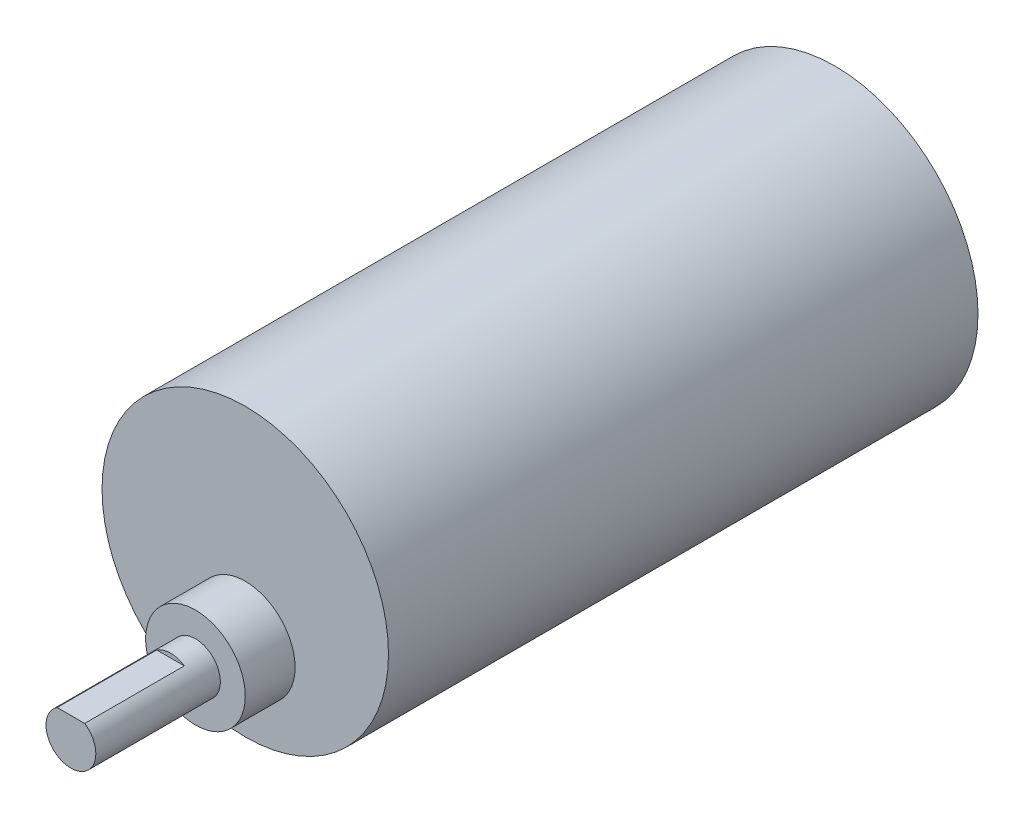
ISO-10303-21;
HEADER;
FILE_DESCRIPTION(('STEP AP214'),'2;1');
FILE_NAME('part.step','',(''),(''),'','','');
FILE_SCHEMA(('AUTOMOTIVE_DESIGN { 1 0 10303 214 1 1 1 1 }'));
ENDSEC;
DATA;
#1=APPLICATION_CONTEXT('core data for automotive mechanical design processes');
#2=APPLICATION_PROTOCOL_DEFINITION('international standard','automotive_design',2000,#1);
#3=PRODUCT_CONTEXT('',#1,'mechanical');
#4=PRODUCT('Part','Part','',(#3));
#5=PRODUCT_RELATED_PRODUCT_CATEGORY('part','',(#4));
#6=PRODUCT_DEFINITION_FORMATION('','',#4);
#7=PRODUCT_DEFINITION_CONTEXT('part definition',#1,'design');
#8=PRODUCT_DEFINITION('design','',#6,#7);
#9=PRODUCT_DEFINITION_SHAPE('','',#8);
#10=(LENGTH_UNIT() NAMED_UNIT(*) SI_UNIT(.MILLI.,.METRE.));
#11=(NAMED_UNIT(*) PLANE_ANGLE_UNIT() SI_UNIT($,.RADIAN.));
#12=(NAMED_UNIT(*) SI_UNIT($,.STERADIAN.) SOLID_ANGLE_UNIT());
#13=UNCERTAINTY_MEASURE_WITH_UNIT(LENGTH_MEASURE(1.E-05),#10,'distance_accuracy_value','');
#14=(GEOMETRIC_REPRESENTATION_CONTEXT(3) GLOBAL_UNCERTAINTY_ASSIGNED_CONTEXT((#13)) GLOBAL_UNIT_ASSIGNED_CONTEXT((#10,
#11,#12)) REPRESENTATION_CONTEXT('',''));
#15=CARTESIAN_POINT('',(0.,0.,0.));
#16=DIRECTION('',(0.,0.,1.));
#17=DIRECTION('',(1.,0.,0.));
#18=AXIS2_PLACEMENT_3D('',#15,#16,#17);
#19=CARTESIAN_POINT('',(0.,0.,71.));
#20=DIRECTION('',(0.,0.,-1.));
#21=DIRECTION('',(-1.,0.,0.));
#22=AXIS2_PLACEMENT_3D('',#19,#20,#21);
#23=CYLINDRICAL_SURFACE('',#22,17.25);
#24=CARTESIAN_POINT('',(0.,0.,71.));
#25=DIRECTION('',(0.,0.,1.));
#26=DIRECTION('',(1.,0.,0.));
#27=AXIS2_PLACEMENT_3D('',#24,#25,#26);
#28=CIRCLE('',#27,17.25);
#29=CARTESIAN_POINT('',(17.25,0.,71.));
#30=VERTEX_POINT('',#29);
#31=EDGE_CURVE('E96',#30,#30,#28,.T.);
#32=ORIENTED_EDGE('',*,*,#31,.F.);
#33=EDGE_LOOP('',(#32));
#34=FACE_BOUND('',#33,.T.);
#35=CARTESIAN_POINT('',(0.,0.,0.));
#36=DIRECTION('',(0.,0.,1.));
#37=DIRECTION('',(1.,0.,0.));
#38=AXIS2_PLACEMENT_3D('',#35,#36,#37);
#39=CIRCLE('',#38,17.25);
#40=CARTESIAN_POINT('',(17.25,0.,0.));
#41=VERTEX_POINT('',#40);
#42=EDGE_CURVE('E99',#41,#41,#39,.T.);
#43=ORIENTED_EDGE('',*,*,#42,.T.);
#44=EDGE_LOOP('',(#43));
#45=FACE_BOUND('',#44,.T.);
#46=ADVANCED_FACE('F43',(#34,#45),#23,.T.);
#47=CARTESIAN_POINT('',(0.,0.,71.));
#48=DIRECTION('',(0.,0.,1.));
#49=DIRECTION('',(1.,0.,0.));
#50=AXIS2_PLACEMENT_3D('',#47,#48,#49);
#51=PLANE('',#50);
#52=CARTESIAN_POINT('',(0.,-7.,71.));
#53=DIRECTION('',(0.,0.,1.));
#54=DIRECTION('',(1.,0.,0.));
#55=AXIS2_PLACEMENT_3D('',#52,#53,#54);
#56=CIRCLE('',#55,6.);
#57=CARTESIAN_POINT('',(6.,-7.,71.));
#58=VERTEX_POINT('',#57);
#59=EDGE_CURVE('E84',#58,#58,#56,.T.);
#60=ORIENTED_EDGE('',*,*,#59,.F.);
#61=EDGE_LOOP('',(#60));
#62=FACE_BOUND('',#61,.T.);
#63=ORIENTED_EDGE('',*,*,#31,.T.);
#64=EDGE_LOOP('',(#63));
#65=FACE_BOUND('',#64,.T.);
#66=ADVANCED_FACE('F112',(#62,#65),#51,.T.);
#67=CARTESIAN_POINT('',(0.,0.,0.));
#68=DIRECTION('',(0.,0.,1.));
#69=DIRECTION('',(1.,0.,0.));
#70=AXIS2_PLACEMENT_3D('',#67,#68,#69);
#71=PLANE('',#70);
#72=ORIENTED_EDGE('',*,*,#42,.F.);
#73=EDGE_LOOP('',(#72));
#74=FACE_BOUND('',#73,.T.);
#75=ADVANCED_FACE('F109',(#74),#71,.F.);
#76=CARTESIAN_POINT('',(0.,-7.,77.));
#77=DIRECTION('',(0.,0.,-1.));
#78=DIRECTION('',(-1.,0.,0.));
#79=AXIS2_PLACEMENT_3D('',#76,#77,#78);
#80=CYLINDRICAL_SURFACE('',#79,6.);
#81=CARTESIAN_POINT('',(0.,-7.,77.));
#82=DIRECTION('',(0.,0.,1.));
#83=DIRECTION('',(1.,0.,0.));
#84=AXIS2_PLACEMENT_3D('',#81,#82,#83);
#85=CIRCLE('',#84,6.);
#86=CARTESIAN_POINT('',(6.,-7.,77.));
#87=VERTEX_POINT('',#86);
#88=EDGE_CURVE('E89',#87,#87,#85,.T.);
#89=ORIENTED_EDGE('',*,*,#88,.F.);
#90=EDGE_LOOP('',(#89));
#91=FACE_BOUND('',#90,.T.);
#92=ORIENTED_EDGE('',*,*,#59,.T.);
#93=EDGE_LOOP('',(#92));
#94=FACE_BOUND('',#93,.T.);
#95=ADVANCED_FACE('F111',(#91,#94),#80,.T.);
#96=CARTESIAN_POINT('',(0.,-7.,77.));
#97=DIRECTION('',(0.,0.,1.));
#98=DIRECTION('',(1.,0.,0.));
#99=AXIS2_PLACEMENT_3D('',#96,#97,#98);
#100=PLANE('',#99);
#101=CARTESIAN_POINT('',(0.,-7.,77.));
#102=DIRECTION('',(0.,0.,1.));
#103=DIRECTION('',(1.,0.,0.));
#104=AXIS2_PLACEMENT_3D('',#101,#102,#103);
#105=CIRCLE('',#104,3.);
#106=CARTESIAN_POINT('',(3.,-7.,77.));
#107=VERTEX_POINT('',#106);
#108=EDGE_CURVE('E74',#107,#107,#105,.T.);
#109=ORIENTED_EDGE('',*,*,#108,.F.);
#110=EDGE_LOOP('',(#109));
#111=FACE_BOUND('',#110,.T.);
#112=ORIENTED_EDGE('',*,*,#88,.T.);
#113=EDGE_LOOP('',(#112));
#114=FACE_BOUND('',#113,.T.);
#115=ADVANCED_FACE('F117',(#111,#114),#100,.T.);
#116=CARTESIAN_POINT('',(0.,-7.,92.));
#117=DIRECTION('',(0.,0.,-1.));
#118=DIRECTION('',(-1.,0.,0.));
#119=AXIS2_PLACEMENT_3D('',#116,#117,#118);
#120=CYLINDRICAL_SURFACE('',#119,3.);
#121=CARTESIAN_POINT('',(0.,-7.,92.));
#122=DIRECTION('',(0.,0.,1.));
#123=DIRECTION('',(1.,0.,0.));
#124=AXIS2_PLACEMENT_3D('',#121,#122,#123);
#125=CIRCLE('',#124,3.);
#126=CARTESIAN_POINT('',(-1.6583123951777,-4.5,92.));
#127=VERTEX_POINT('',#126);
#128=CARTESIAN_POINT('',(1.6583123951777,-4.5,92.));
#129=VERTEX_POINT('',#128);
#130=EDGE_CURVE('E78',#127,#129,#125,.T.);
#131=ORIENTED_EDGE('',*,*,#130,.F.);
#132=DIRECTION('',(0.,0.,-1.));
#133=VECTOR('',#132,1.);
#134=CARTESIAN_POINT('',(-1.6583123951777,-4.5,92.));
#135=LINE('',#134,#133);
#136=CARTESIAN_POINT('',(-1.6583123951777,-4.5,80.));
#137=VERTEX_POINT('',#136);
#138=EDGE_CURVE('E58',#127,#137,#135,.T.);
#139=ORIENTED_EDGE('',*,*,#138,.T.);
#140=CARTESIAN_POINT('',(0.,-7.,80.));
#141=DIRECTION('',(0.,0.,-1.));
#142=DIRECTION('',(-1.,0.,0.));
#143=AXIS2_PLACEMENT_3D('',#140,#141,#142);
#144=CIRCLE('',#143,3.);
#145=CARTESIAN_POINT('',(1.6583123951777,-4.5,80.));
#146=VERTEX_POINT('',#145);
#147=EDGE_CURVE('E11',#137,#146,#144,.T.);
#148=ORIENTED_EDGE('',*,*,#147,.T.);
#149=DIRECTION('',(0.,0.,-1.));
#150=VECTOR('',#149,1.);
#151=CARTESIAN_POINT('',(1.6583123951777,-4.5,92.));
#152=LINE('',#151,#150);
#153=EDGE_CURVE('E63',#146,#129,#152,.F.);
#154=ORIENTED_EDGE('',*,*,#153,.T.);
#155=EDGE_LOOP('',(#131,#139,#148,#154));
#156=FACE_BOUND('',#155,.T.);
#157=ORIENTED_EDGE('',*,*,#108,.T.);
#158=EDGE_LOOP('',(#157));
#159=FACE_BOUND('',#158,.T.);
#160=ADVANCED_FACE('F76',(#156,#159),#120,.T.);
#161=CARTESIAN_POINT('',(0.,-7.,92.));
#162=DIRECTION('',(0.,0.,1.));
#163=DIRECTION('',(1.,0.,0.));
#164=AXIS2_PLACEMENT_3D('',#161,#162,#163);
#165=PLANE('',#164);
#166=DIRECTION('',(1.,0.,0.));
#167=VECTOR('',#166,1.);
#168=CARTESIAN_POINT('',(0.,-4.5,92.));
#169=LINE('',#168,#167);
#170=EDGE_CURVE('E51',#127,#129,#169,.T.);
#171=ORIENTED_EDGE('',*,*,#170,.F.);
#172=ORIENTED_EDGE('',*,*,#130,.T.);
#173=EDGE_LOOP('',(#171,#172));
#174=FACE_BOUND('',#173,.T.);
#175=ADVANCED_FACE('F82',(#174),#165,.T.);
#176=CARTESIAN_POINT('',(0.,0.,80.));
#177=DIRECTION('',(0.,0.,-1.));
#178=DIRECTION('',(-1.,0.,0.));
#179=AXIS2_PLACEMENT_3D('',#176,#177,#178);
#180=PLANE('',#179);
#181=DIRECTION('',(1.,0.,0.));
#182=VECTOR('',#181,1.);
#183=CARTESIAN_POINT('',(-3.40726672636436,-4.5,80.));
#184=LINE('',#183,#182);
#185=EDGE_CURVE('E80',#137,#146,#184,.T.);
#186=ORIENTED_EDGE('',*,*,#185,.T.);
#187=ORIENTED_EDGE('',*,*,#147,.F.);
#188=EDGE_LOOP('',(#186,#187));
#189=FACE_BOUND('',#188,.T.);
#190=ADVANCED_FACE('F170',(#189),#180,.F.);
#191=CARTESIAN_POINT('',(-3.40726672636436,-4.5,80.));
#192=DIRECTION('',(0.,-1.,0.));
#193=DIRECTION('',(0.,0.,-1.));
#194=AXIS2_PLACEMENT_3D('',#191,#192,#193);
#195=PLANE('',#194);
#196=ORIENTED_EDGE('',*,*,#170,.T.);
#197=ORIENTED_EDGE('',*,*,#153,.F.);
#198=ORIENTED_EDGE('',*,*,#185,.F.);
#199=ORIENTED_EDGE('',*,*,#138,.F.);
#200=EDGE_LOOP('',(#196,#197,#198,#199));
#201=FACE_BOUND('',#200,.T.);
#202=ADVANCED_FACE('F69',(#201),#195,.F.);
#203=CLOSED_SHELL('',(#46,#66,#75,#95,#115,#160,#175,#190,#202));
#204=MANIFOLD_SOLID_BREP('B2',#203);
#205=ADVANCED_BREP_SHAPE_REPRESENTATION('',(#18,#204),#14);
#206=SHAPE_DEFINITION_REPRESENTATION(#9,#205);
ENDSEC;
END-ISO-10303-21;
